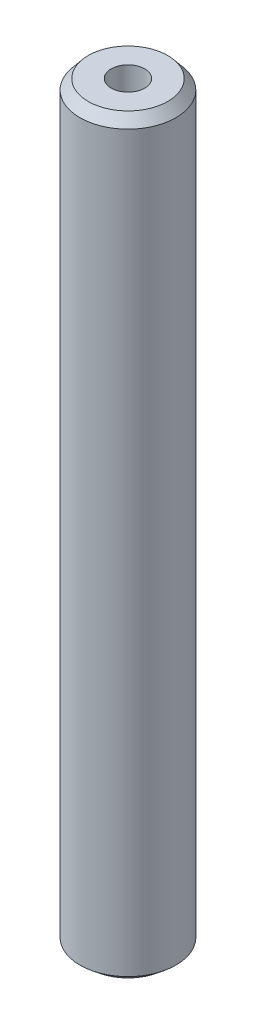
ISO-10303-21;
HEADER;
FILE_DESCRIPTION(('STEP AP214'),'2;1');
FILE_NAME('part.step','',(''),(''),'','','');
FILE_SCHEMA(('AUTOMOTIVE_DESIGN { 1 0 10303 214 1 1 1 1 }'));
ENDSEC;
DATA;
#1=APPLICATION_CONTEXT('core data for automotive mechanical design processes');
#2=APPLICATION_PROTOCOL_DEFINITION('international standard','automotive_design',2000,#1);
#3=PRODUCT_CONTEXT('',#1,'mechanical');
#4=PRODUCT('Part','Part','',(#3));
#5=PRODUCT_RELATED_PRODUCT_CATEGORY('part','',(#4));
#6=PRODUCT_DEFINITION_FORMATION('','',#4);
#7=PRODUCT_DEFINITION_CONTEXT('part definition',#1,'design');
#8=PRODUCT_DEFINITION('design','',#6,#7);
#9=PRODUCT_DEFINITION_SHAPE('','',#8);
#10=(LENGTH_UNIT() NAMED_UNIT(*) SI_UNIT(.MILLI.,.METRE.));
#11=(NAMED_UNIT(*) PLANE_ANGLE_UNIT() SI_UNIT($,.RADIAN.));
#12=(NAMED_UNIT(*) SI_UNIT($,.STERADIAN.) SOLID_ANGLE_UNIT());
#13=UNCERTAINTY_MEASURE_WITH_UNIT(LENGTH_MEASURE(1.E-05),#10,'distance_accuracy_value','');
#14=(GEOMETRIC_REPRESENTATION_CONTEXT(3) GLOBAL_UNCERTAINTY_ASSIGNED_CONTEXT((#13)) GLOBAL_UNIT_ASSIGNED_CONTEXT((#10,
#11,#12)) REPRESENTATION_CONTEXT('',''));
#15=CARTESIAN_POINT('',(0.,0.,0.));
#16=DIRECTION('',(0.,0.,1.));
#17=DIRECTION('',(1.,0.,0.));
#18=AXIS2_PLACEMENT_3D('',#15,#16,#17);
#19=CARTESIAN_POINT('',(0.,430.68562061184,0.));
#20=DIRECTION('',(0.,-1.,0.));
#21=DIRECTION('',(0.,0.,-1.));
#22=AXIS2_PLACEMENT_3D('',#19,#20,#21);
#23=CYLINDRICAL_SURFACE('',#22,27.5);
#24=CARTESIAN_POINT('',(0.,424.982649607356,0.));
#25=DIRECTION('',(0.,1.,0.));
#26=DIRECTION('',(0.,0.,1.));
#27=AXIS2_PLACEMENT_3D('',#24,#25,#26);
#28=CIRCLE('',#27,27.5);
#29=CARTESIAN_POINT('',(0.,424.982649607356,27.5));
#30=VERTEX_POINT('',#29);
#31=EDGE_CURVE('E50',#30,#30,#28,.F.);
#32=ORIENTED_EDGE('',*,*,#31,.T.);
#33=EDGE_LOOP('',(#32));
#34=FACE_BOUND('',#33,.T.);
#35=CARTESIAN_POINT('',(0.,4.71456773229484,0.));
#36=DIRECTION('',(0.,1.,0.));
#37=DIRECTION('',(0.,0.,1.));
#38=AXIS2_PLACEMENT_3D('',#35,#36,#37);
#39=CIRCLE('',#38,27.5);
#40=CARTESIAN_POINT('',(0.,4.71456773229484,27.5));
#41=VERTEX_POINT('',#40);
#42=EDGE_CURVE('E51',#41,#41,#39,.T.);
#43=ORIENTED_EDGE('',*,*,#42,.T.);
#44=EDGE_LOOP('',(#43));
#45=FACE_BOUND('',#44,.T.);
#46=ADVANCED_FACE('F39',(#34,#45),#23,.T.);
#47=CARTESIAN_POINT('',(0.,430.68562061184,0.));
#48=DIRECTION('',(0.,1.,0.));
#49=DIRECTION('',(0.,0.,1.));
#50=AXIS2_PLACEMENT_3D('',#47,#48,#49);
#51=PLANE('',#50);
#52=CARTESIAN_POINT('',(0.,430.68562061184,0.));
#53=DIRECTION('',(0.,1.,0.));
#54=DIRECTION('',(0.,0.,1.));
#55=AXIS2_PLACEMENT_3D('',#52,#53,#54);
#56=CIRCLE('',#55,22.7854322677051);
#57=CARTESIAN_POINT('',(0.,430.68562061184,22.7854322677051));
#58=VERTEX_POINT('',#57);
#59=EDGE_CURVE('E54',#58,#58,#56,.T.);
#60=ORIENTED_EDGE('',*,*,#59,.T.);
#61=EDGE_LOOP('',(#60));
#62=FACE_BOUND('',#61,.T.);
#63=CARTESIAN_POINT('',(0.,430.68562061184,0.));
#64=DIRECTION('',(0.,1.,0.));
#65=DIRECTION('',(0.,0.,1.));
#66=AXIS2_PLACEMENT_3D('',#63,#64,#65);
#67=CIRCLE('',#66,9.59842998027009);
#68=CARTESIAN_POINT('',(0.,430.68562061184,9.59842998027009));
#69=VERTEX_POINT('',#68);
#70=EDGE_CURVE('E58',#69,#69,#67,.T.);
#71=ORIENTED_EDGE('',*,*,#70,.F.);
#72=EDGE_LOOP('',(#71));
#73=FACE_BOUND('',#72,.T.);
#74=ADVANCED_FACE('F69',(#62,#73),#51,.T.);
#75=CARTESIAN_POINT('',(0.,0.,0.));
#76=DIRECTION('',(0.,1.,0.));
#77=DIRECTION('',(0.,0.,1.));
#78=AXIS2_PLACEMENT_3D('',#75,#76,#77);
#79=PLANE('',#78);
#80=CARTESIAN_POINT('',(0.,0.,0.));
#81=DIRECTION('',(0.,1.,0.));
#82=DIRECTION('',(0.,0.,1.));
#83=AXIS2_PLACEMENT_3D('',#80,#81,#82);
#84=CIRCLE('',#83,21.7970289955166);
#85=CARTESIAN_POINT('',(0.,0.,21.7970289955166));
#86=VERTEX_POINT('',#85);
#87=EDGE_CURVE('E10',#86,#86,#84,.F.);
#88=ORIENTED_EDGE('',*,*,#87,.T.);
#89=EDGE_LOOP('',(#88));
#90=FACE_BOUND('',#89,.T.);
#91=CARTESIAN_POINT('',(0.,0.,0.));
#92=DIRECTION('',(0.,1.,0.));
#93=DIRECTION('',(0.,0.,1.));
#94=AXIS2_PLACEMENT_3D('',#91,#92,#93);
#95=CIRCLE('',#94,9.59842998027009);
#96=CARTESIAN_POINT('',(0.,0.,9.59842998027009));
#97=VERTEX_POINT('',#96);
#98=EDGE_CURVE('E63',#97,#97,#95,.T.);
#99=ORIENTED_EDGE('',*,*,#98,.T.);
#100=EDGE_LOOP('',(#99));
#101=FACE_BOUND('',#100,.T.);
#102=ADVANCED_FACE('F75',(#90,#101),#79,.F.);
#103=CARTESIAN_POINT('',(0.,430.68562061184,0.));
#104=DIRECTION('',(0.,-1.,0.));
#105=DIRECTION('',(0.,0.,-1.));
#106=AXIS2_PLACEMENT_3D('',#103,#104,#105);
#107=CYLINDRICAL_SURFACE('',#106,9.59842998027009);
#108=ORIENTED_EDGE('',*,*,#70,.T.);
#109=EDGE_LOOP('',(#108));
#110=FACE_BOUND('',#109,.T.);
#111=ORIENTED_EDGE('',*,*,#98,.F.);
#112=EDGE_LOOP('',(#111));
#113=FACE_BOUND('',#112,.T.);
#114=ADVANCED_FACE('F70',(#110,#113),#107,.F.);
#115=CARTESIAN_POINT('',(0.,430.68562061184,0.));
#116=DIRECTION('',(0.,-1.,0.));
#117=DIRECTION('',(0.,0.,-1.));
#118=AXIS2_PLACEMENT_3D('',#115,#116,#117);
#119=CONICAL_SURFACE('',#118,22.7854322677051,0.690802563474031);
#120=ORIENTED_EDGE('',*,*,#31,.F.);
#121=EDGE_LOOP('',(#120));
#122=FACE_BOUND('',#121,.T.);
#123=ORIENTED_EDGE('',*,*,#59,.F.);
#124=EDGE_LOOP('',(#123));
#125=FACE_BOUND('',#124,.T.);
#126=ADVANCED_FACE('F81',(#122,#125),#119,.T.);
#127=CARTESIAN_POINT('',(0.,4.71456773229484,0.));
#128=DIRECTION('',(0.,1.,0.));
#129=DIRECTION('',(0.,0.,1.));
#130=AXIS2_PLACEMENT_3D('',#127,#128,#129);
#131=CONICAL_SURFACE('',#130,27.5,0.879993763320874);
#132=ORIENTED_EDGE('',*,*,#87,.F.);
#133=EDGE_LOOP('',(#132));
#134=FACE_BOUND('',#133,.T.);
#135=ORIENTED_EDGE('',*,*,#42,.F.);
#136=EDGE_LOOP('',(#135));
#137=FACE_BOUND('',#136,.T.);
#138=ADVANCED_FACE('F45',(#134,#137),#131,.T.);
#139=CLOSED_SHELL('',(#46,#74,#102,#114,#126,#138));
#140=MANIFOLD_SOLID_BREP('B2',#139);
#141=ADVANCED_BREP_SHAPE_REPRESENTATION('',(#18,#140),#14);
#142=SHAPE_DEFINITION_REPRESENTATION(#9,#141);
ENDSEC;
END-ISO-10303-21;
